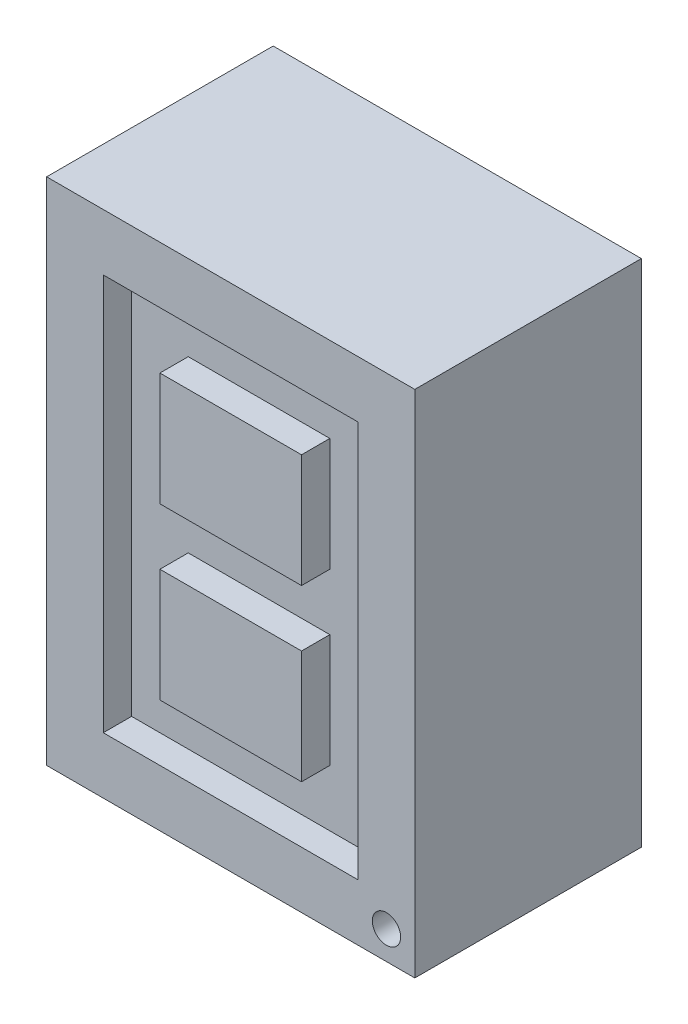
ISO-10303-21;
HEADER;
FILE_DESCRIPTION(('STEP AP214'),'2;1');
FILE_NAME('part.step','',(''),(''),'','','');
FILE_SCHEMA(('AUTOMOTIVE_DESIGN { 1 0 10303 214 1 1 1 1 }'));
ENDSEC;
DATA;
#1=APPLICATION_CONTEXT('core data for automotive mechanical design processes');
#2=APPLICATION_PROTOCOL_DEFINITION('international standard','automotive_design',2000,#1);
#3=PRODUCT_CONTEXT('',#1,'mechanical');
#4=PRODUCT('Part','Part','',(#3));
#5=PRODUCT_RELATED_PRODUCT_CATEGORY('part','',(#4));
#6=PRODUCT_DEFINITION_FORMATION('','',#4);
#7=PRODUCT_DEFINITION_CONTEXT('part definition',#1,'design');
#8=PRODUCT_DEFINITION('design','',#6,#7);
#9=PRODUCT_DEFINITION_SHAPE('','',#8);
#10=(LENGTH_UNIT() NAMED_UNIT(*) SI_UNIT(.MILLI.,.METRE.));
#11=(NAMED_UNIT(*) PLANE_ANGLE_UNIT() SI_UNIT($,.RADIAN.));
#12=(NAMED_UNIT(*) SI_UNIT($,.STERADIAN.) SOLID_ANGLE_UNIT());
#13=UNCERTAINTY_MEASURE_WITH_UNIT(LENGTH_MEASURE(1.E-05),#10,'distance_accuracy_value','');
#14=(GEOMETRIC_REPRESENTATION_CONTEXT(3) GLOBAL_UNCERTAINTY_ASSIGNED_CONTEXT((#13)) GLOBAL_UNIT_ASSIGNED_CONTEXT((#10,
#11,#12)) REPRESENTATION_CONTEXT('',''));
#15=CARTESIAN_POINT('',(0.,0.,0.));
#16=DIRECTION('',(0.,0.,1.));
#17=DIRECTION('',(1.,0.,0.));
#18=AXIS2_PLACEMENT_3D('',#15,#16,#17);
#19=CARTESIAN_POINT('',(0.,0.,8.));
#20=DIRECTION('',(1.,0.,0.));
#21=DIRECTION('',(0.,1.,0.));
#22=AXIS2_PLACEMENT_3D('',#19,#20,#21);
#23=PLANE('',#22);
#24=DIRECTION('',(0.,-1.,0.));
#25=VECTOR('',#24,1.);
#26=CARTESIAN_POINT('',(0.,0.,0.));
#27=LINE('',#26,#25);
#28=CARTESIAN_POINT('',(0.,18.,0.));
#29=VERTEX_POINT('',#28);
#30=CARTESIAN_POINT('',(0.,0.,0.));
#31=VERTEX_POINT('',#30);
#32=EDGE_CURVE('E252',#29,#31,#27,.T.);
#33=ORIENTED_EDGE('',*,*,#32,.T.);
#34=DIRECTION('',(0.,0.,-1.));
#35=VECTOR('',#34,1.);
#36=CARTESIAN_POINT('',(0.,0.,8.));
#37=LINE('',#36,#35);
#38=CARTESIAN_POINT('',(0.,0.,8.));
#39=VERTEX_POINT('',#38);
#40=EDGE_CURVE('E11',#39,#31,#37,.T.);
#41=ORIENTED_EDGE('',*,*,#40,.F.);
#42=DIRECTION('',(0.,-1.,0.));
#43=VECTOR('',#42,1.);
#44=CARTESIAN_POINT('',(0.,0.,8.));
#45=LINE('',#44,#43);
#46=CARTESIAN_POINT('',(0.,18.,8.));
#47=VERTEX_POINT('',#46);
#48=EDGE_CURVE('E258',#47,#39,#45,.T.);
#49=ORIENTED_EDGE('',*,*,#48,.F.);
#50=DIRECTION('',(0.,0.,-1.));
#51=VECTOR('',#50,1.);
#52=CARTESIAN_POINT('',(0.,18.,8.));
#53=LINE('',#52,#51);
#54=EDGE_CURVE('E268',#47,#29,#53,.T.);
#55=ORIENTED_EDGE('',*,*,#54,.T.);
#56=EDGE_LOOP('',(#33,#41,#49,#55));
#57=FACE_BOUND('',#56,.T.);
#58=ADVANCED_FACE('F36',(#57),#23,.F.);
#59=CARTESIAN_POINT('',(0.,0.,8.));
#60=DIRECTION('',(0.,1.,0.));
#61=DIRECTION('',(0.,0.,1.));
#62=AXIS2_PLACEMENT_3D('',#59,#60,#61);
#63=PLANE('',#62);
#64=DIRECTION('',(1.,0.,0.));
#65=VECTOR('',#64,1.);
#66=CARTESIAN_POINT('',(0.,0.,0.));
#67=LINE('',#66,#65);
#68=CARTESIAN_POINT('',(13.,0.,0.));
#69=VERTEX_POINT('',#68);
#70=EDGE_CURVE('E271',#31,#69,#67,.T.);
#71=ORIENTED_EDGE('',*,*,#70,.T.);
#72=DIRECTION('',(0.,0.,-1.));
#73=VECTOR('',#72,1.);
#74=CARTESIAN_POINT('',(13.,0.,8.));
#75=LINE('',#74,#73);
#76=CARTESIAN_POINT('',(13.,0.,8.));
#77=VERTEX_POINT('',#76);
#78=EDGE_CURVE('E43',#77,#69,#75,.T.);
#79=ORIENTED_EDGE('',*,*,#78,.F.);
#80=DIRECTION('',(1.,0.,0.));
#81=VECTOR('',#80,1.);
#82=CARTESIAN_POINT('',(0.,0.,8.));
#83=LINE('',#82,#81);
#84=EDGE_CURVE('E261',#39,#77,#83,.T.);
#85=ORIENTED_EDGE('',*,*,#84,.F.);
#86=ORIENTED_EDGE('',*,*,#40,.T.);
#87=EDGE_LOOP('',(#71,#79,#85,#86));
#88=FACE_BOUND('',#87,.T.);
#89=ADVANCED_FACE('F301',(#88),#63,.F.);
#90=CARTESIAN_POINT('',(13.,0.,8.));
#91=DIRECTION('',(-1.,0.,0.));
#92=DIRECTION('',(0.,-1.,0.));
#93=AXIS2_PLACEMENT_3D('',#90,#91,#92);
#94=PLANE('',#93);
#95=DIRECTION('',(0.,1.,0.));
#96=VECTOR('',#95,1.);
#97=CARTESIAN_POINT('',(13.,0.,0.));
#98=LINE('',#97,#96);
#99=CARTESIAN_POINT('',(13.,18.,0.));
#100=VERTEX_POINT('',#99);
#101=EDGE_CURVE('E273',#69,#100,#98,.T.);
#102=ORIENTED_EDGE('',*,*,#101,.T.);
#103=DIRECTION('',(0.,0.,-1.));
#104=VECTOR('',#103,1.);
#105=CARTESIAN_POINT('',(13.,18.,8.));
#106=LINE('',#105,#104);
#107=CARTESIAN_POINT('',(13.,18.,8.));
#108=VERTEX_POINT('',#107);
#109=EDGE_CURVE('E278',#108,#100,#106,.T.);
#110=ORIENTED_EDGE('',*,*,#109,.F.);
#111=DIRECTION('',(0.,1.,0.));
#112=VECTOR('',#111,1.);
#113=CARTESIAN_POINT('',(13.,0.,8.));
#114=LINE('',#113,#112);
#115=EDGE_CURVE('E264',#77,#108,#114,.T.);
#116=ORIENTED_EDGE('',*,*,#115,.F.);
#117=ORIENTED_EDGE('',*,*,#78,.T.);
#118=EDGE_LOOP('',(#102,#110,#116,#117));
#119=FACE_BOUND('',#118,.T.);
#120=ADVANCED_FACE('F285',(#119),#94,.F.);
#121=CARTESIAN_POINT('',(0.,18.,8.));
#122=DIRECTION('',(0.,-1.,0.));
#123=DIRECTION('',(0.,0.,-1.));
#124=AXIS2_PLACEMENT_3D('',#121,#122,#123);
#125=PLANE('',#124);
#126=DIRECTION('',(-1.,0.,0.));
#127=VECTOR('',#126,1.);
#128=CARTESIAN_POINT('',(0.,18.,0.));
#129=LINE('',#128,#127);
#130=EDGE_CURVE('E262',#100,#29,#129,.T.);
#131=ORIENTED_EDGE('',*,*,#130,.T.);
#132=ORIENTED_EDGE('',*,*,#54,.F.);
#133=DIRECTION('',(-1.,0.,0.));
#134=VECTOR('',#133,1.);
#135=CARTESIAN_POINT('',(0.,18.,8.));
#136=LINE('',#135,#134);
#137=EDGE_CURVE('E266',#108,#47,#136,.T.);
#138=ORIENTED_EDGE('',*,*,#137,.F.);
#139=ORIENTED_EDGE('',*,*,#109,.T.);
#140=EDGE_LOOP('',(#131,#132,#138,#139));
#141=FACE_BOUND('',#140,.T.);
#142=ADVANCED_FACE('F294',(#141),#125,.F.);
#143=CARTESIAN_POINT('',(0.,0.,8.));
#144=DIRECTION('',(0.,0.,-1.));
#145=DIRECTION('',(-1.,0.,0.));
#146=AXIS2_PLACEMENT_3D('',#143,#144,#145);
#147=PLANE('',#146);
#148=CARTESIAN_POINT('',(12.,1.,8.));
#149=DIRECTION('',(0.,0.,1.));
#150=DIRECTION('',(1.,0.,0.));
#151=AXIS2_PLACEMENT_3D('',#148,#149,#150);
#152=CIRCLE('',#151,0.500000000000001);
#153=CARTESIAN_POINT('',(12.5,1.,8.));
#154=VERTEX_POINT('',#153);
#155=EDGE_CURVE('E182',#154,#154,#152,.T.);
#156=ORIENTED_EDGE('',*,*,#155,.F.);
#157=EDGE_LOOP('',(#156));
#158=FACE_BOUND('',#157,.T.);
#159=DIRECTION('',(1.,0.,0.));
#160=VECTOR('',#159,1.);
#161=CARTESIAN_POINT('',(11.,2.,8.));
#162=LINE('',#161,#160);
#163=CARTESIAN_POINT('',(2.,2.,8.));
#164=VERTEX_POINT('',#163);
#165=CARTESIAN_POINT('',(11.,2.,8.));
#166=VERTEX_POINT('',#165);
#167=EDGE_CURVE('E242',#164,#166,#162,.T.);
#168=ORIENTED_EDGE('',*,*,#167,.F.);
#169=DIRECTION('',(0.,-1.,0.));
#170=VECTOR('',#169,1.);
#171=CARTESIAN_POINT('',(2.,2.,8.));
#172=LINE('',#171,#170);
#173=CARTESIAN_POINT('',(2.,16.,8.));
#174=VERTEX_POINT('',#173);
#175=EDGE_CURVE('E50',#174,#164,#172,.T.);
#176=ORIENTED_EDGE('',*,*,#175,.F.);
#177=DIRECTION('',(-1.,0.,0.));
#178=VECTOR('',#177,1.);
#179=CARTESIAN_POINT('',(2.,16.,8.));
#180=LINE('',#179,#178);
#181=CARTESIAN_POINT('',(11.,16.,8.));
#182=VERTEX_POINT('',#181);
#183=EDGE_CURVE('E231',#182,#174,#180,.T.);
#184=ORIENTED_EDGE('',*,*,#183,.F.);
#185=DIRECTION('',(0.,1.,0.));
#186=VECTOR('',#185,1.);
#187=CARTESIAN_POINT('',(11.,16.,8.));
#188=LINE('',#187,#186);
#189=EDGE_CURVE('E245',#166,#182,#188,.T.);
#190=ORIENTED_EDGE('',*,*,#189,.F.);
#191=EDGE_LOOP('',(#168,#176,#184,#190));
#192=FACE_BOUND('',#191,.T.);
#193=ORIENTED_EDGE('',*,*,#48,.T.);
#194=ORIENTED_EDGE('',*,*,#84,.T.);
#195=ORIENTED_EDGE('',*,*,#115,.T.);
#196=ORIENTED_EDGE('',*,*,#137,.T.);
#197=EDGE_LOOP('',(#193,#194,#195,#196));
#198=FACE_BOUND('',#197,.T.);
#199=ADVANCED_FACE('F300',(#158,#192,#198),#147,.F.);
#200=CARTESIAN_POINT('',(0.,0.,0.));
#201=DIRECTION('',(0.,0.,-1.));
#202=DIRECTION('',(-1.,0.,0.));
#203=AXIS2_PLACEMENT_3D('',#200,#201,#202);
#204=PLANE('',#203);
#205=ORIENTED_EDGE('',*,*,#32,.F.);
#206=ORIENTED_EDGE('',*,*,#130,.F.);
#207=ORIENTED_EDGE('',*,*,#101,.F.);
#208=ORIENTED_EDGE('',*,*,#70,.F.);
#209=EDGE_LOOP('',(#205,#206,#207,#208));
#210=FACE_BOUND('',#209,.T.);
#211=ADVANCED_FACE('F291',(#210),#204,.T.);
#212=CARTESIAN_POINT('',(2.,2.,7.));
#213=DIRECTION('',(-1.,0.,0.));
#214=DIRECTION('',(0.,0.,1.));
#215=AXIS2_PLACEMENT_3D('',#212,#213,#214);
#216=PLANE('',#215);
#217=ORIENTED_EDGE('',*,*,#175,.T.);
#218=DIRECTION('',(0.,0.,1.));
#219=VECTOR('',#218,1.);
#220=CARTESIAN_POINT('',(2.,2.,7.));
#221=LINE('',#220,#219);
#222=CARTESIAN_POINT('',(2.,2.,7.));
#223=VERTEX_POINT('',#222);
#224=EDGE_CURVE('E240',#223,#164,#221,.T.);
#225=ORIENTED_EDGE('',*,*,#224,.F.);
#226=DIRECTION('',(0.,-1.,0.));
#227=VECTOR('',#226,1.);
#228=CARTESIAN_POINT('',(2.,2.,7.));
#229=LINE('',#228,#227);
#230=CARTESIAN_POINT('',(2.,16.,7.));
#231=VERTEX_POINT('',#230);
#232=EDGE_CURVE('E227',#231,#223,#229,.T.);
#233=ORIENTED_EDGE('',*,*,#232,.F.);
#234=DIRECTION('',(0.,0.,1.));
#235=VECTOR('',#234,1.);
#236=CARTESIAN_POINT('',(2.,16.,7.));
#237=LINE('',#236,#235);
#238=EDGE_CURVE('E250',#231,#174,#237,.T.);
#239=ORIENTED_EDGE('',*,*,#238,.T.);
#240=EDGE_LOOP('',(#217,#225,#233,#239));
#241=FACE_BOUND('',#240,.T.);
#242=ADVANCED_FACE('F313',(#241),#216,.F.);
#243=CARTESIAN_POINT('',(2.,16.,7.));
#244=DIRECTION('',(0.,1.,0.));
#245=DIRECTION('',(0.,0.,1.));
#246=AXIS2_PLACEMENT_3D('',#243,#244,#245);
#247=PLANE('',#246);
#248=ORIENTED_EDGE('',*,*,#183,.T.);
#249=ORIENTED_EDGE('',*,*,#238,.F.);
#250=DIRECTION('',(-1.,0.,0.));
#251=VECTOR('',#250,1.);
#252=CARTESIAN_POINT('',(2.,16.,7.));
#253=LINE('',#252,#251);
#254=CARTESIAN_POINT('',(11.,16.,7.));
#255=VERTEX_POINT('',#254);
#256=EDGE_CURVE('E237',#255,#231,#253,.T.);
#257=ORIENTED_EDGE('',*,*,#256,.F.);
#258=DIRECTION('',(0.,0.,1.));
#259=VECTOR('',#258,1.);
#260=CARTESIAN_POINT('',(11.,16.,7.));
#261=LINE('',#260,#259);
#262=EDGE_CURVE('E253',#255,#182,#261,.T.);
#263=ORIENTED_EDGE('',*,*,#262,.T.);
#264=EDGE_LOOP('',(#248,#249,#257,#263));
#265=FACE_BOUND('',#264,.T.);
#266=ADVANCED_FACE('F321',(#265),#247,.F.);
#267=CARTESIAN_POINT('',(11.,16.,7.));
#268=DIRECTION('',(1.,0.,0.));
#269=DIRECTION('',(0.,1.,0.));
#270=AXIS2_PLACEMENT_3D('',#267,#268,#269);
#271=PLANE('',#270);
#272=ORIENTED_EDGE('',*,*,#189,.T.);
#273=ORIENTED_EDGE('',*,*,#262,.F.);
#274=DIRECTION('',(0.,1.,0.));
#275=VECTOR('',#274,1.);
#276=CARTESIAN_POINT('',(11.,16.,7.));
#277=LINE('',#276,#275);
#278=CARTESIAN_POINT('',(11.,2.,7.));
#279=VERTEX_POINT('',#278);
#280=EDGE_CURVE('E234',#279,#255,#277,.T.);
#281=ORIENTED_EDGE('',*,*,#280,.F.);
#282=DIRECTION('',(0.,0.,1.));
#283=VECTOR('',#282,1.);
#284=CARTESIAN_POINT('',(11.,2.,7.));
#285=LINE('',#284,#283);
#286=EDGE_CURVE('E255',#279,#166,#285,.T.);
#287=ORIENTED_EDGE('',*,*,#286,.T.);
#288=EDGE_LOOP('',(#272,#273,#281,#287));
#289=FACE_BOUND('',#288,.T.);
#290=ADVANCED_FACE('F325',(#289),#271,.F.);
#291=CARTESIAN_POINT('',(11.,2.,7.));
#292=DIRECTION('',(0.,-1.,0.));
#293=DIRECTION('',(1.,0.,0.));
#294=AXIS2_PLACEMENT_3D('',#291,#292,#293);
#295=PLANE('',#294);
#296=ORIENTED_EDGE('',*,*,#167,.T.);
#297=ORIENTED_EDGE('',*,*,#286,.F.);
#298=DIRECTION('',(1.,0.,0.));
#299=VECTOR('',#298,1.);
#300=CARTESIAN_POINT('',(11.,2.,7.));
#301=LINE('',#300,#299);
#302=EDGE_CURVE('E230',#223,#279,#301,.T.);
#303=ORIENTED_EDGE('',*,*,#302,.F.);
#304=ORIENTED_EDGE('',*,*,#224,.T.);
#305=EDGE_LOOP('',(#296,#297,#303,#304));
#306=FACE_BOUND('',#305,.T.);
#307=ADVANCED_FACE('F322',(#306),#295,.F.);
#308=CARTESIAN_POINT('',(0.,0.,7.));
#309=DIRECTION('',(0.,0.,-1.));
#310=DIRECTION('',(-1.,0.,0.));
#311=AXIS2_PLACEMENT_3D('',#308,#309,#310);
#312=PLANE('',#311);
#313=DIRECTION('',(0.,1.,0.));
#314=VECTOR('',#313,1.);
#315=CARTESIAN_POINT('',(8.99999999999999,8.,7.));
#316=LINE('',#315,#314);
#317=CARTESIAN_POINT('',(8.99999999999999,4.,7.));
#318=VERTEX_POINT('',#317);
#319=CARTESIAN_POINT('',(8.99999999999999,8.,7.));
#320=VERTEX_POINT('',#319);
#321=EDGE_CURVE('E168',#318,#320,#316,.T.);
#322=ORIENTED_EDGE('',*,*,#321,.F.);
#323=DIRECTION('',(1.,0.,0.));
#324=VECTOR('',#323,1.);
#325=CARTESIAN_POINT('',(8.99999999999999,4.,7.));
#326=LINE('',#325,#324);
#327=CARTESIAN_POINT('',(4.,4.,7.));
#328=VERTEX_POINT('',#327);
#329=EDGE_CURVE('E161',#328,#318,#326,.T.);
#330=ORIENTED_EDGE('',*,*,#329,.F.);
#331=DIRECTION('',(0.,-1.,0.));
#332=VECTOR('',#331,1.);
#333=CARTESIAN_POINT('',(4.,4.,7.));
#334=LINE('',#333,#332);
#335=CARTESIAN_POINT('',(4.,8.,7.));
#336=VERTEX_POINT('',#335);
#337=EDGE_CURVE('E171',#336,#328,#334,.T.);
#338=ORIENTED_EDGE('',*,*,#337,.F.);
#339=DIRECTION('',(-1.,0.,0.));
#340=VECTOR('',#339,1.);
#341=CARTESIAN_POINT('',(4.,8.,7.));
#342=LINE('',#341,#340);
#343=EDGE_CURVE('E153',#320,#336,#342,.T.);
#344=ORIENTED_EDGE('',*,*,#343,.F.);
#345=EDGE_LOOP('',(#322,#330,#338,#344));
#346=FACE_BOUND('',#345,.T.);
#347=DIRECTION('',(0.,1.,0.));
#348=VECTOR('',#347,1.);
#349=CARTESIAN_POINT('',(8.99999999999999,14.,7.));
#350=LINE('',#349,#348);
#351=CARTESIAN_POINT('',(8.99999999999999,10.,7.));
#352=VERTEX_POINT('',#351);
#353=CARTESIAN_POINT('',(8.99999999999999,14.,7.));
#354=VERTEX_POINT('',#353);
#355=EDGE_CURVE('E198',#352,#354,#350,.T.);
#356=ORIENTED_EDGE('',*,*,#355,.F.);
#357=DIRECTION('',(1.,0.,0.));
#358=VECTOR('',#357,1.);
#359=CARTESIAN_POINT('',(4.,10.,7.));
#360=LINE('',#359,#358);
#361=CARTESIAN_POINT('',(4.,10.,7.));
#362=VERTEX_POINT('',#361);
#363=EDGE_CURVE('E208',#362,#352,#360,.T.);
#364=ORIENTED_EDGE('',*,*,#363,.F.);
#365=DIRECTION('',(0.,-1.,0.));
#366=VECTOR('',#365,1.);
#367=CARTESIAN_POINT('',(4.,10.,7.));
#368=LINE('',#367,#366);
#369=CARTESIAN_POINT('',(4.,14.,7.));
#370=VERTEX_POINT('',#369);
#371=EDGE_CURVE('E205',#370,#362,#368,.T.);
#372=ORIENTED_EDGE('',*,*,#371,.F.);
#373=DIRECTION('',(-1.,0.,0.));
#374=VECTOR('',#373,1.);
#375=CARTESIAN_POINT('',(4.,14.,7.));
#376=LINE('',#375,#374);
#377=EDGE_CURVE('E201',#354,#370,#376,.T.);
#378=ORIENTED_EDGE('',*,*,#377,.F.);
#379=EDGE_LOOP('',(#356,#364,#372,#378));
#380=FACE_BOUND('',#379,.T.);
#381=ORIENTED_EDGE('',*,*,#232,.T.);
#382=ORIENTED_EDGE('',*,*,#302,.T.);
#383=ORIENTED_EDGE('',*,*,#280,.T.);
#384=ORIENTED_EDGE('',*,*,#256,.T.);
#385=EDGE_LOOP('',(#381,#382,#383,#384));
#386=FACE_BOUND('',#385,.T.);
#387=ADVANCED_FACE('F165',(#346,#380,#386),#312,.F.);
#388=CARTESIAN_POINT('',(8.99999999999999,14.,7.));
#389=DIRECTION('',(1.,0.,0.));
#390=DIRECTION('',(0.,0.,-1.));
#391=AXIS2_PLACEMENT_3D('',#388,#389,#390);
#392=PLANE('',#391);
#393=DIRECTION('',(0.,1.,0.));
#394=VECTOR('',#393,1.);
#395=CARTESIAN_POINT('',(8.99999999999999,14.,8.));
#396=LINE('',#395,#394);
#397=CARTESIAN_POINT('',(8.99999999999999,10.,8.));
#398=VERTEX_POINT('',#397);
#399=CARTESIAN_POINT('',(8.99999999999999,14.,8.));
#400=VERTEX_POINT('',#399);
#401=EDGE_CURVE('E194',#398,#400,#396,.T.);
#402=ORIENTED_EDGE('',*,*,#401,.F.);
#403=DIRECTION('',(0.,0.,1.));
#404=VECTOR('',#403,1.);
#405=CARTESIAN_POINT('',(8.99999999999999,10.,7.));
#406=LINE('',#405,#404);
#407=EDGE_CURVE('E220',#352,#398,#406,.T.);
#408=ORIENTED_EDGE('',*,*,#407,.F.);
#409=ORIENTED_EDGE('',*,*,#355,.T.);
#410=DIRECTION('',(0.,0.,1.));
#411=VECTOR('',#410,1.);
#412=CARTESIAN_POINT('',(8.99999999999999,14.,7.));
#413=LINE('',#412,#411);
#414=EDGE_CURVE('E211',#354,#400,#413,.T.);
#415=ORIENTED_EDGE('',*,*,#414,.T.);
#416=EDGE_LOOP('',(#402,#408,#409,#415));
#417=FACE_BOUND('',#416,.T.);
#418=ADVANCED_FACE('F335',(#417),#392,.T.);
#419=CARTESIAN_POINT('',(4.,10.,7.));
#420=DIRECTION('',(0.,-1.,0.));
#421=DIRECTION('',(0.,0.,-1.));
#422=AXIS2_PLACEMENT_3D('',#419,#420,#421);
#423=PLANE('',#422);
#424=DIRECTION('',(1.,0.,0.));
#425=VECTOR('',#424,1.);
#426=CARTESIAN_POINT('',(4.,10.,8.));
#427=LINE('',#426,#425);
#428=CARTESIAN_POINT('',(4.,10.,8.));
#429=VERTEX_POINT('',#428);
#430=EDGE_CURVE('E202',#429,#398,#427,.T.);
#431=ORIENTED_EDGE('',*,*,#430,.F.);
#432=DIRECTION('',(0.,0.,1.));
#433=VECTOR('',#432,1.);
#434=CARTESIAN_POINT('',(4.,10.,7.));
#435=LINE('',#434,#433);
#436=EDGE_CURVE('E222',#362,#429,#435,.T.);
#437=ORIENTED_EDGE('',*,*,#436,.F.);
#438=ORIENTED_EDGE('',*,*,#363,.T.);
#439=ORIENTED_EDGE('',*,*,#407,.T.);
#440=EDGE_LOOP('',(#431,#437,#438,#439));
#441=FACE_BOUND('',#440,.T.);
#442=ADVANCED_FACE('F338',(#441),#423,.T.);
#443=CARTESIAN_POINT('',(4.,10.,7.));
#444=DIRECTION('',(-1.,0.,0.));
#445=DIRECTION('',(0.,0.,1.));
#446=AXIS2_PLACEMENT_3D('',#443,#444,#445);
#447=PLANE('',#446);
#448=DIRECTION('',(0.,-1.,0.));
#449=VECTOR('',#448,1.);
#450=CARTESIAN_POINT('',(4.,10.,8.));
#451=LINE('',#450,#449);
#452=CARTESIAN_POINT('',(4.,14.,8.));
#453=VERTEX_POINT('',#452);
#454=EDGE_CURVE('E58',#453,#429,#451,.T.);
#455=ORIENTED_EDGE('',*,*,#454,.F.);
#456=DIRECTION('',(0.,0.,1.));
#457=VECTOR('',#456,1.);
#458=CARTESIAN_POINT('',(4.,14.,7.));
#459=LINE('',#458,#457);
#460=EDGE_CURVE('E224',#370,#453,#459,.T.);
#461=ORIENTED_EDGE('',*,*,#460,.F.);
#462=ORIENTED_EDGE('',*,*,#371,.T.);
#463=ORIENTED_EDGE('',*,*,#436,.T.);
#464=EDGE_LOOP('',(#455,#461,#462,#463));
#465=FACE_BOUND('',#464,.T.);
#466=ADVANCED_FACE('F343',(#465),#447,.T.);
#467=CARTESIAN_POINT('',(4.,14.,7.));
#468=DIRECTION('',(0.,1.,0.));
#469=DIRECTION('',(0.,0.,1.));
#470=AXIS2_PLACEMENT_3D('',#467,#468,#469);
#471=PLANE('',#470);
#472=DIRECTION('',(-1.,0.,0.));
#473=VECTOR('',#472,1.);
#474=CARTESIAN_POINT('',(4.,14.,8.));
#475=LINE('',#474,#473);
#476=EDGE_CURVE('E214',#400,#453,#475,.T.);
#477=ORIENTED_EDGE('',*,*,#476,.F.);
#478=ORIENTED_EDGE('',*,*,#414,.F.);
#479=ORIENTED_EDGE('',*,*,#377,.T.);
#480=ORIENTED_EDGE('',*,*,#460,.T.);
#481=EDGE_LOOP('',(#477,#478,#479,#480));
#482=FACE_BOUND('',#481,.T.);
#483=ADVANCED_FACE('F340',(#482),#471,.T.);
#484=CARTESIAN_POINT('',(8.99999999999999,8.,7.));
#485=DIRECTION('',(1.,0.,0.));
#486=DIRECTION('',(0.,0.,-1.));
#487=AXIS2_PLACEMENT_3D('',#484,#485,#486);
#488=PLANE('',#487);
#489=DIRECTION('',(0.,1.,0.));
#490=VECTOR('',#489,1.);
#491=CARTESIAN_POINT('',(8.99999999999999,8.,8.));
#492=LINE('',#491,#490);
#493=CARTESIAN_POINT('',(8.99999999999999,4.,8.));
#494=VERTEX_POINT('',#493);
#495=CARTESIAN_POINT('',(8.99999999999999,8.,8.));
#496=VERTEX_POINT('',#495);
#497=EDGE_CURVE('E187',#494,#496,#492,.T.);
#498=ORIENTED_EDGE('',*,*,#497,.F.);
#499=DIRECTION('',(0.,0.,1.));
#500=VECTOR('',#499,1.);
#501=CARTESIAN_POINT('',(8.99999999999999,4.,7.));
#502=LINE('',#501,#500);
#503=EDGE_CURVE('E175',#318,#494,#502,.T.);
#504=ORIENTED_EDGE('',*,*,#503,.F.);
#505=ORIENTED_EDGE('',*,*,#321,.T.);
#506=DIRECTION('',(0.,0.,1.));
#507=VECTOR('',#506,1.);
#508=CARTESIAN_POINT('',(8.99999999999999,8.,7.));
#509=LINE('',#508,#507);
#510=EDGE_CURVE('E149',#320,#496,#509,.T.);
#511=ORIENTED_EDGE('',*,*,#510,.T.);
#512=EDGE_LOOP('',(#498,#504,#505,#511));
#513=FACE_BOUND('',#512,.T.);
#514=ADVANCED_FACE('F174',(#513),#488,.T.);
#515=CARTESIAN_POINT('',(8.99999999999999,4.,7.));
#516=DIRECTION('',(0.,-1.,0.));
#517=DIRECTION('',(0.,0.,-1.));
#518=AXIS2_PLACEMENT_3D('',#515,#516,#517);
#519=PLANE('',#518);
#520=DIRECTION('',(1.,0.,0.));
#521=VECTOR('',#520,1.);
#522=CARTESIAN_POINT('',(8.99999999999999,4.,8.));
#523=LINE('',#522,#521);
#524=CARTESIAN_POINT('',(4.,4.,8.));
#525=VERTEX_POINT('',#524);
#526=EDGE_CURVE('E176',#525,#494,#523,.T.);
#527=ORIENTED_EDGE('',*,*,#526,.F.);
#528=DIRECTION('',(0.,0.,1.));
#529=VECTOR('',#528,1.);
#530=CARTESIAN_POINT('',(4.,4.,7.));
#531=LINE('',#530,#529);
#532=EDGE_CURVE('E195',#328,#525,#531,.T.);
#533=ORIENTED_EDGE('',*,*,#532,.F.);
#534=ORIENTED_EDGE('',*,*,#329,.T.);
#535=ORIENTED_EDGE('',*,*,#503,.T.);
#536=EDGE_LOOP('',(#527,#533,#534,#535));
#537=FACE_BOUND('',#536,.T.);
#538=ADVANCED_FACE('F352',(#537),#519,.T.);
#539=CARTESIAN_POINT('',(4.,4.,7.));
#540=DIRECTION('',(-1.,0.,0.));
#541=DIRECTION('',(0.,0.,1.));
#542=AXIS2_PLACEMENT_3D('',#539,#540,#541);
#543=PLANE('',#542);
#544=DIRECTION('',(0.,-1.,0.));
#545=VECTOR('',#544,1.);
#546=CARTESIAN_POINT('',(4.,4.,8.));
#547=LINE('',#546,#545);
#548=CARTESIAN_POINT('',(4.,8.,8.));
#549=VERTEX_POINT('',#548);
#550=EDGE_CURVE('E179',#549,#525,#547,.T.);
#551=ORIENTED_EDGE('',*,*,#550,.F.);
#552=DIRECTION('',(0.,0.,1.));
#553=VECTOR('',#552,1.);
#554=CARTESIAN_POINT('',(4.,8.,7.));
#555=LINE('',#554,#553);
#556=EDGE_CURVE('E160',#336,#549,#555,.T.);
#557=ORIENTED_EDGE('',*,*,#556,.F.);
#558=ORIENTED_EDGE('',*,*,#337,.T.);
#559=ORIENTED_EDGE('',*,*,#532,.T.);
#560=EDGE_LOOP('',(#551,#557,#558,#559));
#561=FACE_BOUND('',#560,.T.);
#562=ADVANCED_FACE('F355',(#561),#543,.T.);
#563=CARTESIAN_POINT('',(4.,8.,7.));
#564=DIRECTION('',(0.,1.,0.));
#565=DIRECTION('',(0.,0.,1.));
#566=AXIS2_PLACEMENT_3D('',#563,#564,#565);
#567=PLANE('',#566);
#568=DIRECTION('',(-1.,0.,0.));
#569=VECTOR('',#568,1.);
#570=CARTESIAN_POINT('',(4.,8.,8.));
#571=LINE('',#570,#569);
#572=EDGE_CURVE('E155',#496,#549,#571,.T.);
#573=ORIENTED_EDGE('',*,*,#572,.F.);
#574=ORIENTED_EDGE('',*,*,#510,.F.);
#575=ORIENTED_EDGE('',*,*,#343,.T.);
#576=ORIENTED_EDGE('',*,*,#556,.T.);
#577=EDGE_LOOP('',(#573,#574,#575,#576));
#578=FACE_BOUND('',#577,.T.);
#579=ADVANCED_FACE('F151',(#578),#567,.T.);
#580=ORIENTED_EDGE('',*,*,#401,.T.);
#581=ORIENTED_EDGE('',*,*,#476,.T.);
#582=ORIENTED_EDGE('',*,*,#454,.T.);
#583=ORIENTED_EDGE('',*,*,#430,.T.);
#584=EDGE_LOOP('',(#580,#581,#582,#583));
#585=FACE_BOUND('',#584,.T.);
#586=ADVANCED_FACE('F317',(#585),#147,.F.);
#587=ORIENTED_EDGE('',*,*,#497,.T.);
#588=ORIENTED_EDGE('',*,*,#572,.T.);
#589=ORIENTED_EDGE('',*,*,#550,.T.);
#590=ORIENTED_EDGE('',*,*,#526,.T.);
#591=EDGE_LOOP('',(#587,#588,#589,#590));
#592=FACE_BOUND('',#591,.T.);
#593=ADVANCED_FACE('F318',(#592),#147,.F.);
#594=CARTESIAN_POINT('',(12.,1.,7.));
#595=DIRECTION('',(0.,0.,1.));
#596=DIRECTION('',(1.,0.,0.));
#597=AXIS2_PLACEMENT_3D('',#594,#595,#596);
#598=CYLINDRICAL_SURFACE('',#597,0.500000000000001);
#599=CARTESIAN_POINT('',(12.,1.,7.));
#600=DIRECTION('',(0.,0.,1.));
#601=DIRECTION('',(1.,0.,0.));
#602=AXIS2_PLACEMENT_3D('',#599,#600,#601);
#603=CIRCLE('',#602,0.500000000000001);
#604=CARTESIAN_POINT('',(12.5,1.,7.));
#605=VERTEX_POINT('',#604);
#606=EDGE_CURVE('E189',#605,#605,#603,.T.);
#607=ORIENTED_EDGE('',*,*,#606,.F.);
#608=EDGE_LOOP('',(#607));
#609=FACE_BOUND('',#608,.T.);
#610=ORIENTED_EDGE('',*,*,#155,.T.);
#611=EDGE_LOOP('',(#610));
#612=FACE_BOUND('',#611,.T.);
#613=ADVANCED_FACE('F362',(#609,#612),#598,.F.);
#614=CARTESIAN_POINT('',(12.,1.,7.));
#615=DIRECTION('',(0.,0.,1.));
#616=DIRECTION('',(1.,0.,0.));
#617=AXIS2_PLACEMENT_3D('',#614,#615,#616);
#618=PLANE('',#617);
#619=ORIENTED_EDGE('',*,*,#606,.T.);
#620=EDGE_LOOP('',(#619));
#621=FACE_BOUND('',#620,.T.);
#622=ADVANCED_FACE('F365',(#621),#618,.T.);
#623=CLOSED_SHELL('',(#58,#89,#120,#142,#199,#211,#242,#266,#290,#307,#387,#418,#442,#466,#483,
#514,#538,#562,#579,#586,#593,#613,#622));
#624=MANIFOLD_SOLID_BREP('B2',#623);
#625=ADVANCED_BREP_SHAPE_REPRESENTATION('',(#18,#624),#14);
#626=SHAPE_DEFINITION_REPRESENTATION(#9,#625);
ENDSEC;
END-ISO-10303-21;
